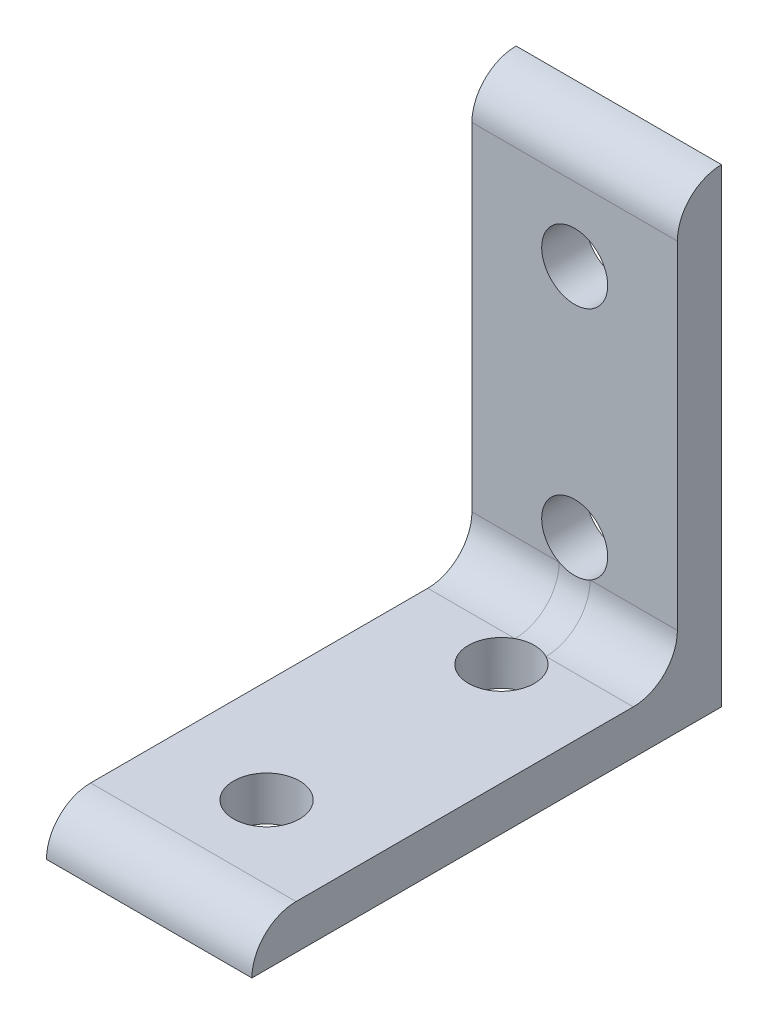
ISO-10303-21;
HEADER;
FILE_DESCRIPTION(('STEP AP214'),'2;1');
FILE_NAME('part.step','',(''),(''),'','','');
FILE_SCHEMA(('AUTOMOTIVE_DESIGN { 1 0 10303 214 1 1 1 1 }'));
ENDSEC;
DATA;
#1=APPLICATION_CONTEXT('core data for automotive mechanical design processes');
#2=APPLICATION_PROTOCOL_DEFINITION('international standard','automotive_design',2000,#1);
#3=PRODUCT_CONTEXT('',#1,'mechanical');
#4=PRODUCT('Part','Part','',(#3));
#5=PRODUCT_RELATED_PRODUCT_CATEGORY('part','',(#4));
#6=PRODUCT_DEFINITION_FORMATION('','',#4);
#7=PRODUCT_DEFINITION_CONTEXT('part definition',#1,'design');
#8=PRODUCT_DEFINITION('design','',#6,#7);
#9=PRODUCT_DEFINITION_SHAPE('','',#8);
#10=(LENGTH_UNIT() NAMED_UNIT(*) SI_UNIT(.MILLI.,.METRE.));
#11=(NAMED_UNIT(*) PLANE_ANGLE_UNIT() SI_UNIT($,.RADIAN.));
#12=(NAMED_UNIT(*) SI_UNIT($,.STERADIAN.) SOLID_ANGLE_UNIT());
#13=UNCERTAINTY_MEASURE_WITH_UNIT(LENGTH_MEASURE(1.E-05),#10,'distance_accuracy_value','');
#14=(GEOMETRIC_REPRESENTATION_CONTEXT(3) GLOBAL_UNCERTAINTY_ASSIGNED_CONTEXT((#13)) GLOBAL_UNIT_ASSIGNED_CONTEXT((#10,
#11,#12)) REPRESENTATION_CONTEXT('',''));
#15=CARTESIAN_POINT('',(0.,0.,0.));
#16=DIRECTION('',(0.,0.,1.));
#17=DIRECTION('',(1.,0.,0.));
#18=AXIS2_PLACEMENT_3D('',#15,#16,#17);
#19=CARTESIAN_POINT('',(22.225,21.8976746849943,23.4239638029782));
#20=DIRECTION('',(-1.,0.,0.));
#21=DIRECTION('',(0.,0.,1.));
#22=AXIS2_PLACEMENT_3D('',#19,#20,#21);
#23=CYLINDRICAL_SURFACE('',#22,4.7752);
#24=CARTESIAN_POINT('',(0.,21.8976746849943,23.4239638029782));
#25=DIRECTION('',(1.,0.,0.));
#26=DIRECTION('',(0.,0.,-1.));
#27=AXIS2_PLACEMENT_3D('',#24,#25,#26);
#28=CIRCLE('',#27,4.7752);
#29=CARTESIAN_POINT('',(0.,26.6728746849943,23.4239638029782));
#30=VERTEX_POINT('',#29);
#31=CARTESIAN_POINT('',(0.,21.8976746849943,28.1991638029782));
#32=VERTEX_POINT('',#31);
#33=EDGE_CURVE('E166',#30,#32,#28,.T.);
#34=ORIENTED_EDGE('',*,*,#33,.T.);
#35=DIRECTION('',(-1.,0.,0.));
#36=VECTOR('',#35,1.);
#37=CARTESIAN_POINT('',(22.225,21.8976746849943,28.1991638029782));
#38=LINE('',#37,#36);
#39=CARTESIAN_POINT('',(22.225,21.8976746849943,28.1991638029782));
#40=VERTEX_POINT('',#39);
#41=EDGE_CURVE('E183',#40,#32,#38,.T.);
#42=ORIENTED_EDGE('',*,*,#41,.F.);
#43=CARTESIAN_POINT('',(22.225,21.8976746849943,23.4239638029782));
#44=DIRECTION('',(1.,0.,0.));
#45=DIRECTION('',(0.,0.,-1.));
#46=AXIS2_PLACEMENT_3D('',#43,#44,#45);
#47=CIRCLE('',#46,4.7752);
#48=CARTESIAN_POINT('',(22.225,26.6728746849943,23.4239638029782));
#49=VERTEX_POINT('',#48);
#50=EDGE_CURVE('E169',#49,#40,#47,.T.);
#51=ORIENTED_EDGE('',*,*,#50,.F.);
#52=DIRECTION('',(-1.,0.,0.));
#53=VECTOR('',#52,1.);
#54=CARTESIAN_POINT('',(22.225,26.6728746849943,23.4239638029782));
#55=LINE('',#54,#53);
#56=EDGE_CURVE('E175',#49,#30,#55,.T.);
#57=ORIENTED_EDGE('',*,*,#56,.T.);
#58=EDGE_LOOP('',(#34,#42,#51,#57));
#59=FACE_BOUND('',#58,.T.);
#60=ADVANCED_FACE('F36',(#59),#23,.T.);
#61=CARTESIAN_POINT('',(22.225,21.8976746849943,28.1991638029782));
#62=DIRECTION('',(0.,1.,0.));
#63=DIRECTION('',(0.,0.,1.));
#64=AXIS2_PLACEMENT_3D('',#61,#62,#63);
#65=PLANE('',#64);
#66=CARTESIAN_POINT('',(11.1125,21.8976746849943,-9.90083619702176));
#67=DIRECTION('',(0.,1.,0.));
#68=DIRECTION('',(0.,0.,1.));
#69=AXIS2_PLACEMENT_3D('',#66,#67,#68);
#70=CIRCLE('',#69,3.5687);
#71=CARTESIAN_POINT('',(11.1125,21.8976746849943,-6.33213619702176));
#72=VERTEX_POINT('',#71);
#73=EDGE_CURVE('E156',#72,#72,#70,.T.);
#74=ORIENTED_EDGE('',*,*,#73,.T.);
#75=EDGE_LOOP('',(#74));
#76=FACE_BOUND('',#75,.T.);
#77=CARTESIAN_POINT('',(11.1125,21.8976746849943,15.4991638029782));
#78=DIRECTION('',(0.,1.,0.));
#79=DIRECTION('',(0.,0.,1.));
#80=AXIS2_PLACEMENT_3D('',#77,#78,#79);
#81=CIRCLE('',#80,3.5687);
#82=CARTESIAN_POINT('',(11.1125,21.8976746849943,19.0678638029782));
#83=VERTEX_POINT('',#82);
#84=EDGE_CURVE('E163',#83,#83,#81,.T.);
#85=ORIENTED_EDGE('',*,*,#84,.T.);
#86=EDGE_LOOP('',(#85));
#87=FACE_BOUND('',#86,.T.);
#88=DIRECTION('',(0.,0.,-1.));
#89=VECTOR('',#88,1.);
#90=CARTESIAN_POINT('',(0.,21.8976746849943,28.1991638029782));
#91=LINE('',#90,#89);
#92=CARTESIAN_POINT('',(0.,21.8976746849943,-22.6008361970218));
#93=VERTEX_POINT('',#92);
#94=EDGE_CURVE('E178',#32,#93,#91,.T.);
#95=ORIENTED_EDGE('',*,*,#94,.T.);
#96=DIRECTION('',(-1.,0.,0.));
#97=VECTOR('',#96,1.);
#98=CARTESIAN_POINT('',(22.225,21.8976746849943,-22.6008361970218));
#99=LINE('',#98,#97);
#100=CARTESIAN_POINT('',(22.225,21.8976746849943,-22.6008361970218));
#101=VERTEX_POINT('',#100);
#102=EDGE_CURVE('E137',#101,#93,#99,.T.);
#103=ORIENTED_EDGE('',*,*,#102,.F.);
#104=DIRECTION('',(0.,0.,-1.));
#105=VECTOR('',#104,1.);
#106=CARTESIAN_POINT('',(22.225,21.8976746849943,28.1991638029782));
#107=LINE('',#106,#105);
#108=EDGE_CURVE('E122',#40,#101,#107,.T.);
#109=ORIENTED_EDGE('',*,*,#108,.F.);
#110=ORIENTED_EDGE('',*,*,#41,.T.);
#111=EDGE_LOOP('',(#95,#103,#109,#110));
#112=FACE_BOUND('',#111,.T.);
#113=ADVANCED_FACE('F234',(#76,#87,#112),#65,.F.);
#114=CARTESIAN_POINT('',(22.225,26.6728746849943,23.4239638029782));
#115=DIRECTION('',(0.,-1.,0.));
#116=DIRECTION('',(0.,0.,-1.));
#117=AXIS2_PLACEMENT_3D('',#114,#115,#116);
#118=PLANE('',#117);
#119=DIRECTION('',(0.,0.,1.));
#120=VECTOR('',#119,1.);
#121=CARTESIAN_POINT('',(22.225,26.6728746849943,23.4239638029782));
#122=LINE('',#121,#120);
#123=CARTESIAN_POINT('',(22.225,26.6728746849943,-13.0504361970216));
#124=VERTEX_POINT('',#123);
#125=EDGE_CURVE('E173',#124,#49,#122,.T.);
#126=ORIENTED_EDGE('',*,*,#125,.F.);
#127=DIRECTION('',(-1.,0.,0.));
#128=VECTOR('',#127,1.);
#129=CARTESIAN_POINT('',(0.,26.6728746849943,-13.0504361970216));
#130=LINE('',#129,#128);
#131=CARTESIAN_POINT('',(12.7904867490539,26.6728746849943,-13.0504361970217));
#132=VERTEX_POINT('',#131);
#133=EDGE_CURVE('E188',#124,#132,#130,.T.);
#134=ORIENTED_EDGE('',*,*,#133,.T.);
#135=CARTESIAN_POINT('',(11.1125,26.6728746849943,-9.90083619702176));
#136=DIRECTION('',(0.,1.,0.));
#137=DIRECTION('',(0.,0.,1.));
#138=AXIS2_PLACEMENT_3D('',#135,#136,#137);
#139=CIRCLE('',#138,3.5687);
#140=CARTESIAN_POINT('',(9.43451325094603,26.6728746849943,-13.0504361970216));
#141=VERTEX_POINT('',#140);
#142=EDGE_CURVE('E136',#141,#132,#139,.T.);
#143=ORIENTED_EDGE('',*,*,#142,.F.);
#144=DIRECTION('',(-1.,0.,0.));
#145=VECTOR('',#144,1.);
#146=CARTESIAN_POINT('',(0.,26.6728746849943,-13.0504361970216));
#147=LINE('',#146,#145);
#148=CARTESIAN_POINT('',(0.,26.6728746849943,-13.0504361970216));
#149=VERTEX_POINT('',#148);
#150=EDGE_CURVE('E186',#141,#149,#147,.T.);
#151=ORIENTED_EDGE('',*,*,#150,.T.);
#152=DIRECTION('',(0.,0.,1.));
#153=VECTOR('',#152,1.);
#154=CARTESIAN_POINT('',(0.,26.6728746849943,23.4239638029782));
#155=LINE('',#154,#153);
#156=EDGE_CURVE('E171',#149,#30,#155,.T.);
#157=ORIENTED_EDGE('',*,*,#156,.T.);
#158=ORIENTED_EDGE('',*,*,#56,.F.);
#159=EDGE_LOOP('',(#126,#134,#143,#151,#157,#158));
#160=FACE_BOUND('',#159,.T.);
#161=CARTESIAN_POINT('',(11.1125,26.6728746849943,15.4991638029782));
#162=DIRECTION('',(0.,1.,0.));
#163=DIRECTION('',(0.,0.,1.));
#164=AXIS2_PLACEMENT_3D('',#161,#162,#163);
#165=CIRCLE('',#164,3.5687);
#166=CARTESIAN_POINT('',(11.1125,26.6728746849943,19.0678638029782));
#167=VERTEX_POINT('',#166);
#168=EDGE_CURVE('E159',#167,#167,#165,.T.);
#169=ORIENTED_EDGE('',*,*,#168,.F.);
#170=EDGE_LOOP('',(#169));
#171=FACE_BOUND('',#170,.T.);
#172=ADVANCED_FACE('F212',(#160,#171),#118,.F.);
#173=CARTESIAN_POINT('',(22.225,21.8976746849943,23.4239638029782));
#174=DIRECTION('',(1.,0.,0.));
#175=DIRECTION('',(0.,0.,-1.));
#176=AXIS2_PLACEMENT_3D('',#173,#174,#175);
#177=PLANE('',#176);
#178=ORIENTED_EDGE('',*,*,#50,.T.);
#179=ORIENTED_EDGE('',*,*,#108,.T.);
#180=DIRECTION('',(0.,-1.,0.));
#181=VECTOR('',#180,1.);
#182=CARTESIAN_POINT('',(22.225,72.6976746849943,-22.6008361970212));
#183=LINE('',#182,#181);
#184=CARTESIAN_POINT('',(22.225,72.6976746849943,-22.6008361970212));
#185=VERTEX_POINT('',#184);
#186=EDGE_CURVE('E115',#185,#101,#183,.T.);
#187=ORIENTED_EDGE('',*,*,#186,.F.);
#188=CARTESIAN_POINT('',(22.225,67.9224746849943,-22.6008361970213));
#189=DIRECTION('',(-1.,0.,0.));
#190=DIRECTION('',(0.,-1.,0.));
#191=AXIS2_PLACEMENT_3D('',#188,#189,#190);
#192=CIRCLE('',#191,4.7752);
#193=CARTESIAN_POINT('',(22.225,67.9224746849942,-17.8256361970213));
#194=VERTEX_POINT('',#193);
#195=EDGE_CURVE('E120',#194,#185,#192,.T.);
#196=ORIENTED_EDGE('',*,*,#195,.F.);
#197=DIRECTION('',(0.,1.,0.));
#198=VECTOR('',#197,1.);
#199=CARTESIAN_POINT('',(22.225,67.9224746849942,-17.8256361970213));
#200=LINE('',#199,#198);
#201=CARTESIAN_POINT('',(22.225,31.4480746849943,-17.8256361970216));
#202=VERTEX_POINT('',#201);
#203=EDGE_CURVE('E126',#202,#194,#200,.T.);
#204=ORIENTED_EDGE('',*,*,#203,.F.);
#205=CARTESIAN_POINT('',(22.225,31.4480746849943,-13.0504361970216));
#206=DIRECTION('',(1.,0.,0.));
#207=DIRECTION('',(0.,0.,-1.));
#208=AXIS2_PLACEMENT_3D('',#205,#206,#207);
#209=CIRCLE('',#208,4.7752);
#210=EDGE_CURVE('E11',#202,#124,#209,.F.);
#211=ORIENTED_EDGE('',*,*,#210,.T.);
#212=ORIENTED_EDGE('',*,*,#125,.T.);
#213=EDGE_LOOP('',(#178,#179,#187,#196,#204,#211,#212));
#214=FACE_BOUND('',#213,.T.);
#215=ADVANCED_FACE('F118',(#214),#177,.T.);
#216=CARTESIAN_POINT('',(0.,21.8976746849943,23.4239638029782));
#217=DIRECTION('',(1.,0.,0.));
#218=DIRECTION('',(0.,0.,-1.));
#219=AXIS2_PLACEMENT_3D('',#216,#217,#218);
#220=PLANE('',#219);
#221=ORIENTED_EDGE('',*,*,#33,.F.);
#222=ORIENTED_EDGE('',*,*,#156,.F.);
#223=CARTESIAN_POINT('',(0.,31.4480746849943,-13.0504361970216));
#224=DIRECTION('',(1.,0.,0.));
#225=DIRECTION('',(0.,0.,-1.));
#226=AXIS2_PLACEMENT_3D('',#223,#224,#225);
#227=CIRCLE('',#226,4.7752);
#228=CARTESIAN_POINT('',(0.,31.4480746849943,-17.8256361970216));
#229=VERTEX_POINT('',#228);
#230=EDGE_CURVE('E52',#149,#229,#227,.T.);
#231=ORIENTED_EDGE('',*,*,#230,.T.);
#232=DIRECTION('',(0.,1.,0.));
#233=VECTOR('',#232,1.);
#234=CARTESIAN_POINT('',(0.,67.9224746849942,-17.8256361970213));
#235=LINE('',#234,#233);
#236=CARTESIAN_POINT('',(0.,67.9224746849942,-17.8256361970213));
#237=VERTEX_POINT('',#236);
#238=EDGE_CURVE('E142',#229,#237,#235,.T.);
#239=ORIENTED_EDGE('',*,*,#238,.T.);
#240=CARTESIAN_POINT('',(0.,67.9224746849943,-22.6008361970213));
#241=DIRECTION('',(-1.,0.,0.));
#242=DIRECTION('',(0.,-1.,0.));
#243=AXIS2_PLACEMENT_3D('',#240,#241,#242);
#244=CIRCLE('',#243,4.7752);
#245=CARTESIAN_POINT('',(0.,72.6976746849943,-22.6008361970212));
#246=VERTEX_POINT('',#245);
#247=EDGE_CURVE('E150',#237,#246,#244,.T.);
#248=ORIENTED_EDGE('',*,*,#247,.T.);
#249=DIRECTION('',(0.,-1.,0.));
#250=VECTOR('',#249,1.);
#251=CARTESIAN_POINT('',(0.,72.6976746849943,-22.6008361970212));
#252=LINE('',#251,#250);
#253=EDGE_CURVE('E132',#246,#93,#252,.T.);
#254=ORIENTED_EDGE('',*,*,#253,.T.);
#255=ORIENTED_EDGE('',*,*,#94,.F.);
#256=EDGE_LOOP('',(#221,#222,#231,#239,#248,#254,#255));
#257=FACE_BOUND('',#256,.T.);
#258=ADVANCED_FACE('F226',(#257),#220,.F.);
#259=CARTESIAN_POINT('',(11.1125,21.8976746849943,15.4991638029782));
#260=DIRECTION('',(0.,1.,0.));
#261=DIRECTION('',(0.,0.,1.));
#262=AXIS2_PLACEMENT_3D('',#259,#260,#261);
#263=CYLINDRICAL_SURFACE('',#262,3.5687);
#264=ORIENTED_EDGE('',*,*,#84,.F.);
#265=EDGE_LOOP('',(#264));
#266=FACE_BOUND('',#265,.T.);
#267=ORIENTED_EDGE('',*,*,#168,.T.);
#268=EDGE_LOOP('',(#267));
#269=FACE_BOUND('',#268,.T.);
#270=ADVANCED_FACE('F221',(#266,#269),#263,.F.);
#271=CARTESIAN_POINT('',(11.1125,21.8976746849943,-9.90083619702176));
#272=DIRECTION('',(0.,1.,0.));
#273=DIRECTION('',(0.,0.,1.));
#274=AXIS2_PLACEMENT_3D('',#271,#272,#273);
#275=CYLINDRICAL_SURFACE('',#274,3.5687);
#276=ORIENTED_EDGE('',*,*,#73,.F.);
#277=EDGE_LOOP('',(#276));
#278=FACE_BOUND('',#277,.T.);
#279=EDGE_CURVE('E160',#132,#141,#139,.T.);
#280=ORIENTED_EDGE('',*,*,#279,.T.);
#281=ORIENTED_EDGE('',*,*,#142,.T.);
#282=EDGE_LOOP('',(#280,#281));
#283=FACE_BOUND('',#282,.T.);
#284=ADVANCED_FACE('F216',(#278,#283),#275,.F.);
#285=CARTESIAN_POINT('',(22.225,67.9224746849943,-22.6008361970213));
#286=DIRECTION('',(-1.,0.,0.));
#287=DIRECTION('',(0.,1.,0.));
#288=AXIS2_PLACEMENT_3D('',#285,#286,#287);
#289=CYLINDRICAL_SURFACE('',#288,4.7752);
#290=ORIENTED_EDGE('',*,*,#247,.F.);
#291=DIRECTION('',(-1.,0.,0.));
#292=VECTOR('',#291,1.);
#293=CARTESIAN_POINT('',(22.225,67.9224746849942,-17.8256361970213));
#294=LINE('',#293,#292);
#295=EDGE_CURVE('E141',#194,#237,#294,.T.);
#296=ORIENTED_EDGE('',*,*,#295,.F.);
#297=ORIENTED_EDGE('',*,*,#195,.T.);
#298=DIRECTION('',(-1.,0.,0.));
#299=VECTOR('',#298,1.);
#300=CARTESIAN_POINT('',(22.225,72.6976746849943,-22.6008361970212));
#301=LINE('',#300,#299);
#302=EDGE_CURVE('E129',#185,#246,#301,.T.);
#303=ORIENTED_EDGE('',*,*,#302,.T.);
#304=EDGE_LOOP('',(#290,#296,#297,#303));
#305=FACE_BOUND('',#304,.T.);
#306=ADVANCED_FACE('F139',(#305),#289,.T.);
#307=CARTESIAN_POINT('',(22.225,72.6976746849943,-22.6008361970212));
#308=DIRECTION('',(0.,0.,1.));
#309=DIRECTION('',(0.,1.,0.));
#310=AXIS2_PLACEMENT_3D('',#307,#308,#309);
#311=PLANE('',#310);
#312=CARTESIAN_POINT('',(11.1125,34.5976746849943,-22.6008361970216));
#313=DIRECTION('',(0.,0.,-1.));
#314=DIRECTION('',(0.,1.,0.));
#315=AXIS2_PLACEMENT_3D('',#312,#313,#314);
#316=CIRCLE('',#315,3.5687);
#317=CARTESIAN_POINT('',(11.1125,38.1663746849943,-22.6008361970216));
#318=VERTEX_POINT('',#317);
#319=EDGE_CURVE('E263',#318,#318,#316,.T.);
#320=ORIENTED_EDGE('',*,*,#319,.F.);
#321=EDGE_LOOP('',(#320));
#322=FACE_BOUND('',#321,.T.);
#323=CARTESIAN_POINT('',(11.1125,59.9976746849943,-22.6008361970213));
#324=DIRECTION('',(0.,0.,-1.));
#325=DIRECTION('',(0.,1.,0.));
#326=AXIS2_PLACEMENT_3D('',#323,#324,#325);
#327=CIRCLE('',#326,3.5687);
#328=CARTESIAN_POINT('',(11.1125,63.5663746849943,-22.6008361970213));
#329=VERTEX_POINT('',#328);
#330=EDGE_CURVE('E152',#329,#329,#327,.T.);
#331=ORIENTED_EDGE('',*,*,#330,.F.);
#332=EDGE_LOOP('',(#331));
#333=FACE_BOUND('',#332,.T.);
#334=ORIENTED_EDGE('',*,*,#253,.F.);
#335=ORIENTED_EDGE('',*,*,#302,.F.);
#336=ORIENTED_EDGE('',*,*,#186,.T.);
#337=ORIENTED_EDGE('',*,*,#102,.T.);
#338=EDGE_LOOP('',(#334,#335,#336,#337));
#339=FACE_BOUND('',#338,.T.);
#340=ADVANCED_FACE('F130',(#322,#333,#339),#311,.F.);
#341=CARTESIAN_POINT('',(22.225,67.9224746849942,-17.8256361970213));
#342=DIRECTION('',(0.,0.,-1.));
#343=DIRECTION('',(0.,-1.,0.));
#344=AXIS2_PLACEMENT_3D('',#341,#342,#343);
#345=PLANE('',#344);
#346=ORIENTED_EDGE('',*,*,#238,.F.);
#347=DIRECTION('',(-1.,0.,0.));
#348=VECTOR('',#347,1.);
#349=CARTESIAN_POINT('',(22.225,31.4480746849943,-17.8256361970216));
#350=LINE('',#349,#348);
#351=CARTESIAN_POINT('',(9.43451325094603,31.4480746849943,-17.8256361970216));
#352=VERTEX_POINT('',#351);
#353=EDGE_CURVE('E192',#229,#352,#350,.F.);
#354=ORIENTED_EDGE('',*,*,#353,.T.);
#355=CARTESIAN_POINT('',(11.1125,34.5976746849942,-17.8256361970216));
#356=DIRECTION('',(0.,0.,-1.));
#357=DIRECTION('',(0.,1.,0.));
#358=AXIS2_PLACEMENT_3D('',#355,#356,#357);
#359=CIRCLE('',#358,3.5687);
#360=CARTESIAN_POINT('',(12.790486749054,31.4480746849943,-17.8256361970216));
#361=VERTEX_POINT('',#360);
#362=EDGE_CURVE('E200',#352,#361,#359,.T.);
#363=ORIENTED_EDGE('',*,*,#362,.T.);
#364=DIRECTION('',(-1.,0.,0.));
#365=VECTOR('',#364,1.);
#366=CARTESIAN_POINT('',(22.225,31.4480746849943,-17.8256361970216));
#367=LINE('',#366,#365);
#368=EDGE_CURVE('E60',#361,#202,#367,.F.);
#369=ORIENTED_EDGE('',*,*,#368,.T.);
#370=ORIENTED_EDGE('',*,*,#203,.T.);
#371=ORIENTED_EDGE('',*,*,#295,.T.);
#372=EDGE_LOOP('',(#346,#354,#363,#369,#370,#371));
#373=FACE_BOUND('',#372,.T.);
#374=CARTESIAN_POINT('',(11.1125,59.9976746849942,-17.8256361970213));
#375=DIRECTION('',(0.,0.,-1.));
#376=DIRECTION('',(0.,1.,0.));
#377=AXIS2_PLACEMENT_3D('',#374,#375,#376);
#378=CIRCLE('',#377,3.5687);
#379=CARTESIAN_POINT('',(11.1125,63.5663746849942,-17.8256361970213));
#380=VERTEX_POINT('',#379);
#381=EDGE_CURVE('E146',#380,#380,#378,.T.);
#382=ORIENTED_EDGE('',*,*,#381,.T.);
#383=EDGE_LOOP('',(#382));
#384=FACE_BOUND('',#383,.T.);
#385=ADVANCED_FACE('F273',(#373,#384),#345,.F.);
#386=CARTESIAN_POINT('',(11.1125,59.9976746849943,-22.6008361970213));
#387=DIRECTION('',(0.,0.,1.));
#388=DIRECTION('',(0.,1.,0.));
#389=AXIS2_PLACEMENT_3D('',#386,#387,#388);
#390=CYLINDRICAL_SURFACE('',#389,3.5687);
#391=ORIENTED_EDGE('',*,*,#330,.T.);
#392=EDGE_LOOP('',(#391));
#393=FACE_BOUND('',#392,.T.);
#394=ORIENTED_EDGE('',*,*,#381,.F.);
#395=EDGE_LOOP('',(#394));
#396=FACE_BOUND('',#395,.T.);
#397=ADVANCED_FACE('F275',(#393,#396),#390,.F.);
#398=CARTESIAN_POINT('',(11.1125,34.5976746849943,-22.6008361970216));
#399=DIRECTION('',(0.,0.,1.));
#400=DIRECTION('',(0.,1.,0.));
#401=AXIS2_PLACEMENT_3D('',#398,#399,#400);
#402=CYLINDRICAL_SURFACE('',#401,3.5687);
#403=ORIENTED_EDGE('',*,*,#319,.T.);
#404=EDGE_LOOP('',(#403));
#405=FACE_BOUND('',#404,.T.);
#406=EDGE_CURVE('E260',#361,#352,#359,.T.);
#407=ORIENTED_EDGE('',*,*,#406,.F.);
#408=ORIENTED_EDGE('',*,*,#362,.F.);
#409=EDGE_LOOP('',(#407,#408));
#410=FACE_BOUND('',#409,.T.);
#411=ADVANCED_FACE('F277',(#405,#410),#402,.F.);
#412=CARTESIAN_POINT('',(22.225,31.4480746849943,-13.0504361970216));
#413=DIRECTION('',(1.,0.,0.));
#414=DIRECTION('',(0.,0.,-1.));
#415=AXIS2_PLACEMENT_3D('',#412,#413,#414);
#416=CYLINDRICAL_SURFACE('',#415,4.7752);
#417=ORIENTED_EDGE('',*,*,#230,.F.);
#418=ORIENTED_EDGE('',*,*,#150,.F.);
#419=CARTESIAN_POINT('',(9.43451325094603,31.4480746849943,-13.0504361970217));
#420=DIRECTION('',(-1.,0.,0.));
#421=DIRECTION('',(0.,0.,1.));
#422=AXIS2_PLACEMENT_3D('',#419,#420,#421);
#423=CIRCLE('',#422,4.7752);
#424=EDGE_CURVE('E197',#352,#141,#423,.T.);
#425=ORIENTED_EDGE('',*,*,#424,.F.);
#426=ORIENTED_EDGE('',*,*,#353,.F.);
#427=EDGE_LOOP('',(#417,#418,#425,#426));
#428=FACE_BOUND('',#427,.T.);
#429=ADVANCED_FACE('F253',(#428),#416,.F.);
#430=CARTESIAN_POINT('',(8.74865551605279,31.9241266779982,-17.8256361970216));
#431=CARTESIAN_POINT('',(9.46326186164712,26.0908892349341,-18.407621703914));
#432=CARTESIAN_POINT('',(8.74865556687603,26.6728746849943,-12.5743842489537));
#433=CARTESIAN_POINT('',(8.78451098262395,31.892444234666,-17.8256361970216));
#434=CARTESIAN_POINT('',(9.40267034387381,26.1339873043522,-18.3645235978683));
#435=CARTESIAN_POINT('',(8.7845110008308,26.6728746849943,-12.6060666634713));
#436=CARTESIAN_POINT('',(8.82346232349616,31.8592711602678,-17.8256361970216));
#437=CARTESIAN_POINT('',(9.35617119951118,26.1796112733825,-18.3188996139939));
#438=CARTESIAN_POINT('',(8.82346232836531,26.6728746849943,-12.639239726065));
#439=CARTESIAN_POINT('',(8.90791494847003,31.790824970103,-17.8256361970216));
#440=CARTESIAN_POINT('',(9.29129393828677,26.2718237480344,-18.2266871287278));
#441=CARTESIAN_POINT('',(8.90791494360907,26.6728746849943,-12.7076859076031));
#442=CARTESIAN_POINT('',(8.95341072636571,31.7555536342083,-17.8256361970216));
#443=CARTESIAN_POINT('',(9.27239225355385,26.318380070089,-18.1801308105429));
#444=CARTESIAN_POINT('',(8.95341072509814,26.6728746849943,-12.7429572466631));
#445=CARTESIAN_POINT('',(9.05121078955535,31.6838523450431,-17.8256361970216));
#446=CARTESIAN_POINT('',(9.2604649843854,26.4093739351034,-18.0891369482696));
#447=CARTESIAN_POINT('',(9.05121079082131,26.6728746849943,-12.8146585381155));
#448=CARTESIAN_POINT('',(9.10349259396244,31.6474265049695,-17.8256361970216));
#449=CARTESIAN_POINT('',(9.26690128340909,26.4538606215776,-18.0446502607707));
#450=CARTESIAN_POINT('',(9.10349259418352,26.6728746849943,-12.851084377324));
#451=CARTESIAN_POINT('',(9.21524107955582,31.5743508894693,-17.8256361970216));
#452=CARTESIAN_POINT('',(9.3024697409706,26.5389238885445,-17.9595869931452));
#453=CARTESIAN_POINT('',(9.21524107933547,26.6728746849943,-12.9241599922696));
#454=CARTESIAN_POINT('',(9.27470940716051,31.5377010645609,-17.8256361970217));
#455=CARTESIAN_POINT('',(9.33124009098332,26.5795953355439,-17.9189155464887));
#456=CARTESIAN_POINT('',(9.27470940754399,26.6728746849943,-12.9608098174887));
#457=CARTESIAN_POINT('',(9.40083848892409,31.4654056958782,-17.8256361970217));
#458=CARTESIAN_POINT('',(9.40832301832199,26.6557552091104,-17.8427556728862));
#459=CARTESIAN_POINT('',(9.40083848853598,26.6728746849943,-13.0331051861013));
#460=CARTESIAN_POINT('',(9.46749188628268,31.4297591711236,-17.8256361970217));
#461=CARTESIAN_POINT('',(9.45635714504307,26.6913703671913,-17.8071405144381));
#462=CARTESIAN_POINT('',(9.46749188452118,26.6728746849943,-13.0687517104758));
#463=CARTESIAN_POINT('',(9.60788966062648,31.3607184312292,-17.8256361970217));
#464=CARTESIAN_POINT('',(9.56884796640732,26.7568585525311,-17.7416523298718));
#465=CARTESIAN_POINT('',(9.60788966240013,26.6728746849943,-13.1377924512093));
#466=CARTESIAN_POINT('',(9.68163429811137,31.3273242989086,-17.8256361970217));
#467=CARTESIAN_POINT('',(9.63316293613969,26.7868597424096,-17.7116511411138));
#468=CARTESIAN_POINT('',(9.68163430479379,26.6728746849943,-13.171186584749));
#469=CARTESIAN_POINT('',(9.83582837660476,31.2641080226699,-17.8256361970217));
#470=CARTESIAN_POINT('',(9.77525541572204,26.8409588678759,-17.6575520126404));
#471=CARTESIAN_POINT('',(9.83582836989383,26.6728746849943,-13.2344028576935));
#472=CARTESIAN_POINT('',(9.91628205253613,31.234288164316,-17.8256361970217));
#473=CARTESIAN_POINT('',(9.85301115216184,26.865173133908,-17.6333377425373));
#474=CARTESIAN_POINT('',(9.91628202750833,26.6728746849943,-13.2642227115303));
#475=CARTESIAN_POINT('',(10.0830887797594,31.1795382521341,-17.8256361970217));
#476=CARTESIAN_POINT('',(10.0190651635828,26.9077818564935,-17.5907290310414));
#477=CARTESIAN_POINT('',(10.0830888047981,26.6728746849943,-13.3189726360551));
#478=CARTESIAN_POINT('',(10.1694420672006,31.1546083941974,-17.8256361970217));
#479=CARTESIAN_POINT('',(10.1074331262245,26.926277560901,-17.572233341618));
#480=CARTESIAN_POINT('',(10.1694421606262,26.6728746849943,-13.3439025108524));
#481=CARTESIAN_POINT('',(10.4142759255803,31.0942781333747,-17.8256361970217));
#482=CARTESIAN_POINT('',(10.3611753326789,26.9694571719404,-17.5290537428312));
#483=CARTESIAN_POINT('',(10.4142760764016,26.6728746849943,-13.4042327858266));
#484=CARTESIAN_POINT('',(10.5778239628121,31.0652599867166,-17.8256361970217));
#485=CARTESIAN_POINT('',(10.5361018092549,26.9887478761766,-17.5097630145729));
#486=CARTESIAN_POINT('',(10.5778240032138,26.6728746849943,-13.433250905262));
#487=CARTESIAN_POINT('',(10.9118628430827,31.0306673455199,-17.8256361970217));
#488=CARTESIAN_POINT('',(10.8949566905659,27.0113421447748,-17.487168728557));
#489=CARTESIAN_POINT('',(10.9118628026692,26.6728746849943,-13.4678435265329));
#490=CARTESIAN_POINT('',(11.0823529237473,31.0250902836583,-17.8256361970217));
#491=CARTESIAN_POINT('',(11.0802301142627,27.0148265405557,-17.4836843391349));
#492=CARTESIAN_POINT('',(11.0823529129229,26.6728746849943,-13.4734205956876));
#493=CARTESIAN_POINT('',(11.4206088311865,31.03827366713,-17.8256361970217));
#494=CARTESIAN_POINT('',(11.4453697526573,27.0063738365576,-17.4921370477878));
#495=CARTESIAN_POINT('',(11.4206088420114,26.6728746849943,-13.4602372175549));
#496=CARTESIAN_POINT('',(11.5883756075716,31.0570254360843,-17.8256361970217));
#497=CARTESIAN_POINT('',(11.6266802171009,26.9943751507521,-17.5041357318931));
#498=CARTESIAN_POINT('',(11.5883756104703,26.6728746849943,-13.4414854466498));
#499=CARTESIAN_POINT('',(11.9122913535613,31.1158491140461,-17.8256361970217));
#500=CARTESIAN_POINT('',(11.9700938217338,26.954260345582,-17.5442505357973));
#501=CARTESIAN_POINT('',(11.9122913506678,26.6728746849943,-13.3826617672505));
#502=CARTESIAN_POINT('',(12.0684371051551,31.1559269036481,-17.8256361970217));
#503=CARTESIAN_POINT('',(12.1333039800741,26.9258250374669,-17.572685844364));
#504=CARTESIAN_POINT('',(12.0684371043985,26.6728746849943,-13.3425839781624));
#505=CARTESIAN_POINT('',(12.3626197655141,31.2515073183371,-17.8256361970217));
#506=CARTESIAN_POINT('',(12.426826617637,26.8516666584421,-17.6468442237582));
#507=CARTESIAN_POINT('',(12.3626197662861,26.6728746849943,-13.2470035638799));
#508=CARTESIAN_POINT('',(12.5006322741423,31.3070304199518,-17.8256361970217));
#509=CARTESIAN_POINT('',(12.5574898912569,26.8053688950582,-17.6931419870509));
#510=CARTESIAN_POINT('',(12.5006322743025,26.6728746849943,-13.191480462157));
#511=CARTESIAN_POINT('',(12.7547041241498,31.4261567740003,-17.8256361970217));
#512=CARTESIAN_POINT('',(12.7710681514613,26.6955702334573,-17.8029406484574));
#513=CARTESIAN_POINT('',(12.7547041240027,26.6728746849943,-13.0723541079169));
#514=CARTESIAN_POINT('',(12.8707783769405,31.489754488618,-17.8256361970216));
#515=CARTESIAN_POINT('',(12.8534097328248,26.6313782374989,-17.8671326443117));
#516=CARTESIAN_POINT('',(12.8707783770972,26.6728746849943,-13.0087563932158));
#517=CARTESIAN_POINT('',(13.0281141178482,31.5860572414799,-17.8256361970216));
#518=CARTESIAN_POINT('',(12.9293233844646,26.525629608944,-17.9728812731808));
#519=CARTESIAN_POINT('',(13.0281141177638,26.6728746849943,-12.9124536406309));
#520=CARTESIAN_POINT('',(13.0777968720471,31.618335719013,-17.8256361970216));
#521=CARTESIAN_POINT('',(12.9466504050504,26.4882763329176,-18.0102345493954));
#522=CARTESIAN_POINT('',(13.0777968717658,26.6728746849943,-12.8801751632575));
#523=CARTESIAN_POINT('',(13.1716588356032,31.6824199399343,-17.8256361970216));
#524=CARTESIAN_POINT('',(12.9634626281003,26.4111518662624,-18.0873590154511));
#525=CARTESIAN_POINT('',(13.1716588358857,26.6728746849943,-12.8160909418263));
#526=CARTESIAN_POINT('',(13.2158389482887,31.7142257601583,-17.8256361970216));
#527=CARTESIAN_POINT('',(12.9626770175354,26.3713266030679,-18.1271842778428));
#528=CARTESIAN_POINT('',(13.2158389493318,26.6728746849943,-12.7842851209329));
#529=CARTESIAN_POINT('',(13.2989989213918,31.7767595029757,-17.8256361970216));
#530=CARTESIAN_POINT('',(12.9413648835307,26.2905749272032,-18.2079359559514));
#531=CARTESIAN_POINT('',(13.2989989203313,26.6728746849943,-12.7217513799783));
#532=CARTESIAN_POINT('',(13.3379655963989,31.8074845528746,-17.8256361970216));
#533=CARTESIAN_POINT('',(12.9204673819566,26.2496274897844,-18.2488833964893));
#534=CARTESIAN_POINT('',(13.3379655924651,26.6728746849943,-12.6910263326195));
#535=CARTESIAN_POINT('',(13.4108694036566,31.8672311912948,-17.8256361970216));
#536=CARTESIAN_POINT('',(12.8574816743529,26.1687329335823,-18.3297779441154));
#537=CARTESIAN_POINT('',(13.4108694075807,26.6728746849943,-12.6312796872508));
#538=CARTESIAN_POINT('',(13.4448034696815,31.8962517348592,-17.8256361970216));
#539=CARTESIAN_POINT('',(12.8150382578475,26.128814663671,-18.3696962020783));
#540=CARTESIAN_POINT('',(13.4448034843452,26.6728746849943,-12.6022591341904));
#541=CARTESIAN_POINT('',(13.4763479401889,31.9241297338732,-17.8256361970216));
#542=CARTESIAN_POINT('',(12.761732269418,26.0908849345209,-18.4076259018156));
#543=CARTESIAN_POINT('',(13.4763479810384,26.6728746849943,-12.5743811120252));
#544=(BOUNDED_SURFACE() B_SPLINE_SURFACE(3,2,((#430,#431,#432),(#433,#434,#435),(#436,#437,
#438),(#439,#440,#441),(#442,#443,#444),(#445,#446,#447),(#448,#449,#450),(#451,#452,#453),
(#454,#455,#456),(#457,#458,#459),(#460,#461,#462),(#463,#464,#465),(#466,#467,#468),(#469,#470,
#471),(#472,#473,#474),(#475,#476,#477),(#478,#479,#480),(#481,#482,#483),(#484,#485,#486),
(#487,#488,#489),(#490,#491,#492),(#493,#494,#495),(#496,#497,#498),(#499,#500,#501),(#502,#503,
#504),(#505,#506,#507),(#508,#509,#510),(#511,#512,#513),(#514,#515,#516),(#517,#518,#519),
(#520,#521,#522),(#523,#524,#525),(#526,#527,#528),(#529,#530,#531),(#532,#533,#534),(#535,#536,
#537),(#538,#539,#540),(#541,#542,#543)),.UNSPECIFIED.,.F.,.F.,
.F.) B_SPLINE_SURFACE_WITH_KNOTS((4,2,2,2,2,2,2,2,2,2,2,2,2,2,2,2,2,2,4),(3,3),(0.,
0.257813805202279,0.51541195215838,0.772177521952595,1.02900202815366,1.28556602529158,
1.54213945101873,1.79887607674279,2.05562298513611,2.50693828456191,2.95820415357895,
3.40930913209789,3.86053856614511,4.3123690894573,4.76389139077508,4.99001938803257,
5.21611021444708,5.44276245780254,5.66955223156539),(0.,1.),
.UNSPECIFIED.) GEOMETRIC_REPRESENTATION_ITEM() RATIONAL_B_SPLINE_SURFACE(((1.,0.628759193473815,
1.),(1.,0.634566617851589,1.),(1.,0.640503648336097,1.),(1.,0.652461819351013,1.),(1.,
0.658482885370132,1.),(1.,0.670424979694853,1.),(1.,0.676346268432083,1.),(1.,0.687945478602592,
1.),(1.,0.693623343862853,1.),(1.,0.704572680551964,1.),(1.,0.709844558363063,1.),(1.,
0.719845519880293,1.),(1.,0.724574583631912,1.),(1.,0.733365339608893,1.),(1.,0.737426605422427,
1.),(1.,0.744771268346097,1.),(1.,0.748054634294962,1.),(1.,0.755913089631228,1.),(1.,
0.759581458417743,1.),(1.,0.763939522270521,1.),(1.,0.764629543532682,1.),(1.,0.762979275299727,
1.),(1.,0.760640066118144,1.),(1.,0.753116469088791,1.),(1.,0.747931296461619,1.),(1.,
0.735123549167711,1.),(1.,0.727497736803652,1.),(1.,0.710442191066296,1.),(1.,0.701013691809526,
1.),(1.,0.686101620157656,1.),(1.,0.680998260152571,1.),(1.,0.670648455908869,1.),(1.,
0.665402035328286,1.),(1.,0.654865342580214,1.),(1.,0.649574993872304,1.),(1.,0.639075824946947,
1.),(1.,0.633867056148084,1.),(1.,0.628758626421662,1.))) REPRESENTATION_ITEM('') SURFACE());
#545=ORIENTED_EDGE('',*,*,#424,.T.);
#546=ORIENTED_EDGE('',*,*,#279,.F.);
#547=CARTESIAN_POINT('',(12.7904867490539,31.4480746849943,-13.0504361970217));
#548=DIRECTION('',(-1.,0.,0.));
#549=DIRECTION('',(0.,0.,1.));
#550=AXIS2_PLACEMENT_3D('',#547,#548,#549);
#551=CIRCLE('',#550,4.7752);
#552=EDGE_CURVE('E195',#361,#132,#551,.T.);
#553=ORIENTED_EDGE('',*,*,#552,.F.);
#554=ORIENTED_EDGE('',*,*,#406,.T.);
#555=EDGE_LOOP('',(#545,#546,#553,#554));
#556=FACE_BOUND('',#555,.T.);
#557=ADVANCED_FACE('F38',(#556),#544,.F.);
#558=CARTESIAN_POINT('',(22.225,31.4480746849943,-13.0504361970216));
#559=DIRECTION('',(1.,0.,0.));
#560=DIRECTION('',(0.,0.,-1.));
#561=AXIS2_PLACEMENT_3D('',#558,#559,#560);
#562=CYLINDRICAL_SURFACE('',#561,4.7752);
#563=ORIENTED_EDGE('',*,*,#210,.F.);
#564=ORIENTED_EDGE('',*,*,#368,.F.);
#565=ORIENTED_EDGE('',*,*,#552,.T.);
#566=ORIENTED_EDGE('',*,*,#133,.F.);
#567=EDGE_LOOP('',(#563,#564,#565,#566));
#568=FACE_BOUND('',#567,.T.);
#569=ADVANCED_FACE('F207',(#568),#562,.F.);
#570=CLOSED_SHELL('',(#60,#113,#172,#215,#258,#270,#284,#306,#340,#385,#397,#411,#429,#557,#569));
#571=MANIFOLD_SOLID_BREP('B2',#570);
#572=ADVANCED_BREP_SHAPE_REPRESENTATION('',(#18,#571),#14);
#573=SHAPE_DEFINITION_REPRESENTATION(#9,#572);
ENDSEC;
END-ISO-10303-21;
